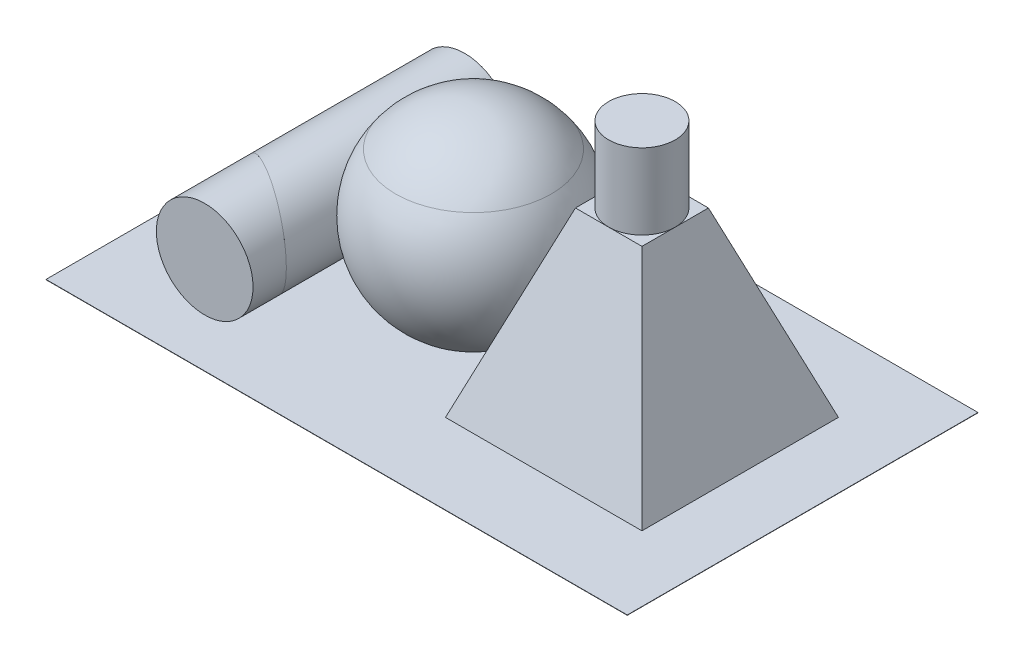
ISO-10303-21;
HEADER;
FILE_DESCRIPTION(('STEP AP214'),'2;1');
FILE_NAME('part.step','',(''),(''),'','','');
FILE_SCHEMA(('AUTOMOTIVE_DESIGN { 1 0 10303 214 1 1 1 1 }'));
ENDSEC;
DATA;
#1=APPLICATION_CONTEXT('core data for automotive mechanical design processes');
#2=APPLICATION_PROTOCOL_DEFINITION('international standard','automotive_design',2000,#1);
#3=PRODUCT_CONTEXT('',#1,'mechanical');
#4=PRODUCT('Part','Part','',(#3));
#5=PRODUCT_RELATED_PRODUCT_CATEGORY('part','',(#4));
#6=PRODUCT_DEFINITION_FORMATION('','',#4);
#7=PRODUCT_DEFINITION_CONTEXT('part definition',#1,'design');
#8=PRODUCT_DEFINITION('design','',#6,#7);
#9=PRODUCT_DEFINITION_SHAPE('','',#8);
#10=(LENGTH_UNIT() NAMED_UNIT(*) SI_UNIT(.MILLI.,.METRE.));
#11=(NAMED_UNIT(*) PLANE_ANGLE_UNIT() SI_UNIT($,.RADIAN.));
#12=(NAMED_UNIT(*) SI_UNIT($,.STERADIAN.) SOLID_ANGLE_UNIT());
#13=UNCERTAINTY_MEASURE_WITH_UNIT(LENGTH_MEASURE(1.E-05),#10,'distance_accuracy_value','');
#14=(GEOMETRIC_REPRESENTATION_CONTEXT(3) GLOBAL_UNCERTAINTY_ASSIGNED_CONTEXT((#13)) GLOBAL_UNIT_ASSIGNED_CONTEXT((#10,
#11,#12)) REPRESENTATION_CONTEXT('',''));
#15=CARTESIAN_POINT('',(0.,0.,0.));
#16=DIRECTION('',(0.,0.,1.));
#17=DIRECTION('',(1.,0.,0.));
#18=AXIS2_PLACEMENT_3D('',#15,#16,#17);
#19=CARTESIAN_POINT('',(-105.610948662013,-0.1,-56.9919444298044));
#20=DIRECTION('',(-1.,0.,0.));
#21=DIRECTION('',(0.,0.,1.));
#22=AXIS2_PLACEMENT_3D('',#19,#20,#21);
#23=PLANE('',#22);
#24=DIRECTION('',(0.,0.,1.));
#25=VECTOR('',#24,1.);
#26=CARTESIAN_POINT('',(-105.610948662013,0.,-56.9919444298044));
#27=LINE('',#26,#25);
#28=CARTESIAN_POINT('',(-105.610948662013,0.,-56.9919444298044));
#29=VERTEX_POINT('',#28);
#30=CARTESIAN_POINT('',(-105.610948662013,0.,59.0420143733231));
#31=VERTEX_POINT('',#30);
#32=EDGE_CURVE('E114',#29,#31,#27,.T.);
#33=ORIENTED_EDGE('',*,*,#32,.F.);
#34=DIRECTION('',(0.,1.,0.));
#35=VECTOR('',#34,1.);
#36=CARTESIAN_POINT('',(-105.610948662013,-0.1,-56.9919444298044));
#37=LINE('',#36,#35);
#38=CARTESIAN_POINT('',(-105.610948662013,-0.1,-56.9919444298044));
#39=VERTEX_POINT('',#38);
#40=EDGE_CURVE('E12',#39,#29,#37,.T.);
#41=ORIENTED_EDGE('',*,*,#40,.F.);
#42=DIRECTION('',(0.,0.,1.));
#43=VECTOR('',#42,1.);
#44=CARTESIAN_POINT('',(-105.610948662013,-0.1,-56.9919444298044));
#45=LINE('',#44,#43);
#46=CARTESIAN_POINT('',(-105.610948662013,-0.1,59.0420143733231));
#47=VERTEX_POINT('',#46);
#48=EDGE_CURVE('E108',#39,#47,#45,.T.);
#49=ORIENTED_EDGE('',*,*,#48,.T.);
#50=DIRECTION('',(0.,1.,0.));
#51=VECTOR('',#50,1.);
#52=CARTESIAN_POINT('',(-105.610948662013,-0.1,59.0420143733231));
#53=LINE('',#52,#51);
#54=EDGE_CURVE('E53',#47,#31,#53,.T.);
#55=ORIENTED_EDGE('',*,*,#54,.T.);
#56=EDGE_LOOP('',(#33,#41,#49,#55));
#57=FACE_BOUND('',#56,.T.);
#58=ADVANCED_FACE('F50',(#57),#23,.T.);
#59=CARTESIAN_POINT('',(-105.610948662013,-0.1,-56.9919444298044));
#60=DIRECTION('',(0.,0.,-1.));
#61=DIRECTION('',(-1.,0.,0.));
#62=AXIS2_PLACEMENT_3D('',#59,#60,#61);
#63=PLANE('',#62);
#64=DIRECTION('',(-1.,0.,0.));
#65=VECTOR('',#64,1.);
#66=CARTESIAN_POINT('',(-105.610948662013,0.,-56.9919444298044));
#67=LINE('',#66,#65);
#68=CARTESIAN_POINT('',(86.6856120399894,0.,-56.9919444298044));
#69=VERTEX_POINT('',#68);
#70=EDGE_CURVE('E110',#69,#29,#67,.T.);
#71=ORIENTED_EDGE('',*,*,#70,.F.);
#72=DIRECTION('',(0.,1.,0.));
#73=VECTOR('',#72,1.);
#74=CARTESIAN_POINT('',(86.6856120399894,-0.1,-56.9919444298044));
#75=LINE('',#74,#73);
#76=CARTESIAN_POINT('',(86.6856120399894,-0.1,-56.9919444298044));
#77=VERTEX_POINT('',#76);
#78=EDGE_CURVE('E59',#77,#69,#75,.T.);
#79=ORIENTED_EDGE('',*,*,#78,.F.);
#80=DIRECTION('',(-1.,0.,0.));
#81=VECTOR('',#80,1.);
#82=CARTESIAN_POINT('',(-105.610948662013,-0.1,-56.9919444298044));
#83=LINE('',#82,#81);
#84=EDGE_CURVE('E105',#77,#39,#83,.T.);
#85=ORIENTED_EDGE('',*,*,#84,.T.);
#86=ORIENTED_EDGE('',*,*,#40,.T.);
#87=EDGE_LOOP('',(#71,#79,#85,#86));
#88=FACE_BOUND('',#87,.T.);
#89=ADVANCED_FACE('F124',(#88),#63,.T.);
#90=CARTESIAN_POINT('',(86.6856120399894,-0.1,-56.9919444298044));
#91=DIRECTION('',(1.,0.,0.));
#92=DIRECTION('',(0.,0.,-1.));
#93=AXIS2_PLACEMENT_3D('',#90,#91,#92);
#94=PLANE('',#93);
#95=DIRECTION('',(0.,0.,-1.));
#96=VECTOR('',#95,1.);
#97=CARTESIAN_POINT('',(86.6856120399894,0.,-56.9919444298044));
#98=LINE('',#97,#96);
#99=CARTESIAN_POINT('',(86.6856120399894,0.,59.0420143733231));
#100=VERTEX_POINT('',#99);
#101=EDGE_CURVE('E100',#100,#69,#98,.T.);
#102=ORIENTED_EDGE('',*,*,#101,.F.);
#103=DIRECTION('',(0.,1.,0.));
#104=VECTOR('',#103,1.);
#105=CARTESIAN_POINT('',(86.6856120399894,-0.1,59.0420143733231));
#106=LINE('',#105,#104);
#107=CARTESIAN_POINT('',(86.6856120399894,-0.1,59.0420143733231));
#108=VERTEX_POINT('',#107);
#109=EDGE_CURVE('E95',#108,#100,#106,.T.);
#110=ORIENTED_EDGE('',*,*,#109,.F.);
#111=DIRECTION('',(0.,0.,-1.));
#112=VECTOR('',#111,1.);
#113=CARTESIAN_POINT('',(86.6856120399894,-0.1,-56.9919444298044));
#114=LINE('',#113,#112);
#115=EDGE_CURVE('E98',#108,#77,#114,.T.);
#116=ORIENTED_EDGE('',*,*,#115,.T.);
#117=ORIENTED_EDGE('',*,*,#78,.T.);
#118=EDGE_LOOP('',(#102,#110,#116,#117));
#119=FACE_BOUND('',#118,.T.);
#120=ADVANCED_FACE('F97',(#119),#94,.T.);
#121=CARTESIAN_POINT('',(-105.610948662013,-0.1,59.0420143733231));
#122=DIRECTION('',(0.,0.,1.));
#123=DIRECTION('',(1.,0.,0.));
#124=AXIS2_PLACEMENT_3D('',#121,#122,#123);
#125=PLANE('',#124);
#126=DIRECTION('',(1.,0.,0.));
#127=VECTOR('',#126,1.);
#128=CARTESIAN_POINT('',(-105.610948662013,0.,59.0420143733231));
#129=LINE('',#128,#127);
#130=EDGE_CURVE('E117',#31,#100,#129,.T.);
#131=ORIENTED_EDGE('',*,*,#130,.F.);
#132=ORIENTED_EDGE('',*,*,#54,.F.);
#133=DIRECTION('',(1.,0.,0.));
#134=VECTOR('',#133,1.);
#135=CARTESIAN_POINT('',(-105.610948662013,-0.1,59.0420143733231));
#136=LINE('',#135,#134);
#137=EDGE_CURVE('E104',#47,#108,#136,.T.);
#138=ORIENTED_EDGE('',*,*,#137,.T.);
#139=ORIENTED_EDGE('',*,*,#109,.T.);
#140=EDGE_LOOP('',(#131,#132,#138,#139));
#141=FACE_BOUND('',#140,.T.);
#142=ADVANCED_FACE('F107',(#141),#125,.T.);
#143=CARTESIAN_POINT('',(0.,-0.1,0.));
#144=DIRECTION('',(0.,1.,0.));
#145=DIRECTION('',(0.,0.,1.));
#146=AXIS2_PLACEMENT_3D('',#143,#144,#145);
#147=PLANE('',#146);
#148=ORIENTED_EDGE('',*,*,#48,.F.);
#149=ORIENTED_EDGE('',*,*,#84,.F.);
#150=ORIENTED_EDGE('',*,*,#115,.F.);
#151=ORIENTED_EDGE('',*,*,#137,.F.);
#152=EDGE_LOOP('',(#148,#149,#150,#151));
#153=FACE_BOUND('',#152,.T.);
#154=ADVANCED_FACE('F103',(#153),#147,.F.);
#155=CARTESIAN_POINT('',(0.,0.,0.));
#156=DIRECTION('',(0.,1.,0.));
#157=DIRECTION('',(0.,0.,1.));
#158=AXIS2_PLACEMENT_3D('',#155,#156,#157);
#159=PLANE('',#158);
#160=ORIENTED_EDGE('',*,*,#32,.T.);
#161=ORIENTED_EDGE('',*,*,#130,.T.);
#162=ORIENTED_EDGE('',*,*,#101,.T.);
#163=ORIENTED_EDGE('',*,*,#70,.T.);
#164=EDGE_LOOP('',(#160,#161,#162,#163));
#165=FACE_BOUND('',#164,.T.);
#166=ADVANCED_FACE('F123',(#165),#159,.T.);
#167=CLOSED_SHELL('',(#58,#89,#120,#142,#154,#166));
#168=MANIFOLD_SOLID_BREP('B2',#167);
#169=CARTESIAN_POINT('',(-69.1553785881351,16.,-25.9929118946907));
#170=DIRECTION('',(0.,0.,1.));
#171=DIRECTION('',(1.,0.,0.));
#172=AXIS2_PLACEMENT_3D('',#169,#170,#171);
#173=CYLINDRICAL_SURFACE('',#172,16.);
#174=CARTESIAN_POINT('',(-69.1553785881351,16.,22.7623956929661));
#175=DIRECTION('',(-0.499999999999998,0.,0.86602540378444));
#176=DIRECTION('',(0.86602540378444,0.,0.499999999999998));
#177=AXIS2_PLACEMENT_3D('',#174,#175,#176);
#178=ELLIPSE('',#177,18.475208614068,16.);
#179=CARTESIAN_POINT('',(-53.1553785881351,16.,32.));
#180=VERTEX_POINT('',#179);
#181=EDGE_CURVE('E49',#180,#180,#178,.F.);
#182=ORIENTED_EDGE('',*,*,#181,.F.);
#183=EDGE_LOOP('',(#182));
#184=FACE_BOUND('',#183,.T.);
#185=CARTESIAN_POINT('',(-69.1553785881351,16.,43.));
#186=DIRECTION('',(0.,0.,1.));
#187=DIRECTION('',(1.,0.,0.));
#188=AXIS2_PLACEMENT_3D('',#185,#186,#187);
#189=CIRCLE('',#188,16.);
#190=CARTESIAN_POINT('',(-53.1553785881351,16.,43.));
#191=VERTEX_POINT('',#190);
#192=EDGE_CURVE('E188',#191,#191,#189,.T.);
#193=ORIENTED_EDGE('',*,*,#192,.F.);
#194=EDGE_LOOP('',(#193));
#195=FACE_BOUND('',#194,.T.);
#196=ADVANCED_FACE('F182',(#184,#195),#173,.T.);
#197=CARTESIAN_POINT('',(-69.1553785881351,16.,43.));
#198=DIRECTION('',(0.,0.,1.));
#199=DIRECTION('',(1.,0.,0.));
#200=AXIS2_PLACEMENT_3D('',#197,#198,#199);
#201=PLANE('',#200);
#202=ORIENTED_EDGE('',*,*,#192,.T.);
#203=EDGE_LOOP('',(#202));
#204=FACE_BOUND('',#203,.T.);
#205=ADVANCED_FACE('F194',(#204),#201,.T.);
#206=CARTESIAN_POINT('',(-53.1553785881351,62.,32.));
#207=DIRECTION('',(-0.499999999999998,0.,0.86602540378444));
#208=DIRECTION('',(0.86602540378444,0.,0.499999999999998));
#209=AXIS2_PLACEMENT_3D('',#206,#207,#208);
#210=PLANE('',#209);
#211=ORIENTED_EDGE('',*,*,#181,.T.);
#212=EDGE_LOOP('',(#211));
#213=FACE_BOUND('',#212,.T.);
#214=ADVANCED_FACE('F201',(#213),#210,.F.);
#215=CLOSED_SHELL('',(#196,#205,#214));
#216=MANIFOLD_SOLID_BREP('B6',#215);
#217=CARTESIAN_POINT('',(-69.1553785881351,16.,43.));
#218=DIRECTION('',(0.,0.,-1.));
#219=DIRECTION('',(-1.,0.,0.));
#220=AXIS2_PLACEMENT_3D('',#217,#218,#219);
#221=CYLINDRICAL_SURFACE('',#220,16.);
#222=CARTESIAN_POINT('',(-69.1553785881351,16.,-43.));
#223=DIRECTION('',(0.,0.,1.));
#224=DIRECTION('',(1.,0.,0.));
#225=AXIS2_PLACEMENT_3D('',#222,#223,#224);
#226=CIRCLE('',#225,16.);
#227=CARTESIAN_POINT('',(-53.1553785881351,16.,-43.));
#228=VERTEX_POINT('',#227);
#229=EDGE_CURVE('E237',#228,#228,#226,.T.);
#230=ORIENTED_EDGE('',*,*,#229,.T.);
#231=EDGE_LOOP('',(#230));
#232=FACE_BOUND('',#231,.T.);
#233=CARTESIAN_POINT('',(-69.1553785881351,16.,22.7623956929661));
#234=DIRECTION('',(-0.499999999999998,0.,0.86602540378444));
#235=DIRECTION('',(-0.86602540378444,0.,-0.499999999999998));
#236=AXIS2_PLACEMENT_3D('',#233,#234,#235);
#237=ELLIPSE('',#236,18.475208614068,16.);
#238=CARTESIAN_POINT('',(-85.1553785881351,16.,13.5247913859321));
#239=VERTEX_POINT('',#238);
#240=EDGE_CURVE('E181',#239,#239,#237,.T.);
#241=ORIENTED_EDGE('',*,*,#240,.F.);
#242=EDGE_LOOP('',(#241));
#243=FACE_BOUND('',#242,.T.);
#244=ADVANCED_FACE('F231',(#232,#243),#221,.T.);
#245=CARTESIAN_POINT('',(-69.1553785881351,16.,-43.));
#246=DIRECTION('',(0.,0.,1.));
#247=DIRECTION('',(1.,0.,0.));
#248=AXIS2_PLACEMENT_3D('',#245,#246,#247);
#249=PLANE('',#248);
#250=ORIENTED_EDGE('',*,*,#229,.F.);
#251=EDGE_LOOP('',(#250));
#252=FACE_BOUND('',#251,.T.);
#253=ADVANCED_FACE('F245',(#252),#249,.F.);
#254=CARTESIAN_POINT('',(-53.1553785881351,62.,32.));
#255=DIRECTION('',(-0.499999999999998,0.,0.86602540378444));
#256=DIRECTION('',(0.86602540378444,0.,0.499999999999998));
#257=AXIS2_PLACEMENT_3D('',#254,#255,#256);
#258=PLANE('',#257);
#259=ORIENTED_EDGE('',*,*,#240,.T.);
#260=EDGE_LOOP('',(#259));
#261=FACE_BOUND('',#260,.T.);
#262=ADVANCED_FACE('F247',(#261),#258,.T.);
#263=CLOSED_SHELL('',(#244,#253,#262));
#264=MANIFOLD_SOLID_BREP('B44',#263);
#265=CARTESIAN_POINT('',(-23.2424174551391,49.,0.));
#266=DIRECTION('',(0.,-1.,0.));
#267=DIRECTION('',(0.,0.,-1.));
#268=AXIS2_PLACEMENT_3D('',#265,#266,#267);
#269=PLANE('',#268);
#270=CARTESIAN_POINT('',(-23.2424174551391,49.,0.));
#271=DIRECTION('',(0.,-1.,0.));
#272=DIRECTION('',(0.,0.,-1.));
#273=AXIS2_PLACEMENT_3D('',#270,#271,#272);
#274=CIRCLE('',#273,25.7487863791675);
#275=CARTESIAN_POINT('',(-23.2424174551391,49.,-25.7487863791675));
#276=VERTEX_POINT('',#275);
#277=EDGE_CURVE('E230',#276,#276,#274,.T.);
#278=ORIENTED_EDGE('',*,*,#277,.T.);
#279=EDGE_LOOP('',(#278));
#280=FACE_BOUND('',#279,.T.);
#281=ADVANCED_FACE('F282',(#280),#269,.T.);
#282=CARTESIAN_POINT('',(-23.2424174551391,30.,0.));
#283=DIRECTION('',(0.,-1.,0.));
#284=DIRECTION('',(1.,0.,0.));
#285=AXIS2_PLACEMENT_3D('',#282,#283,#284);
#286=SPHERICAL_SURFACE('',#285,32.);
#287=ORIENTED_EDGE('',*,*,#277,.F.);
#288=EDGE_LOOP('',(#287));
#289=FACE_BOUND('',#288,.T.);
#290=ADVANCED_FACE('F290',(#289),#286,.T.);
#291=CLOSED_SHELL('',(#281,#290));
#292=MANIFOLD_SOLID_BREP('B176',#291);
#293=CARTESIAN_POINT('',(-12.106888729479,0.,0.));
#294=DIRECTION('',(0.,-1.,0.));
#295=DIRECTION('',(0.,0.,-1.));
#296=AXIS2_PLACEMENT_3D('',#293,#294,#295);
#297=PLANE('',#296);
#298=CARTESIAN_POINT('',(-23.2424174551391,0.,0.));
#299=DIRECTION('',(0.,-1.,0.));
#300=DIRECTION('',(0.,0.,-1.));
#301=AXIS2_PLACEMENT_3D('',#298,#299,#300);
#302=CIRCLE('',#301,11.13552872566);
#303=CARTESIAN_POINT('',(-23.2424174551391,0.,-11.13552872566));
#304=VERTEX_POINT('',#303);
#305=EDGE_CURVE('E280',#304,#304,#302,.T.);
#306=ORIENTED_EDGE('',*,*,#305,.T.);
#307=EDGE_LOOP('',(#306));
#308=FACE_BOUND('',#307,.T.);
#309=ADVANCED_FACE('F317',(#308),#297,.T.);
#310=CARTESIAN_POINT('',(-23.2424174551391,30.,0.));
#311=DIRECTION('',(0.,-1.,0.));
#312=DIRECTION('',(1.,0.,0.));
#313=AXIS2_PLACEMENT_3D('',#310,#311,#312);
#314=SPHERICAL_SURFACE('',#313,32.);
#315=CARTESIAN_POINT('',(-53.8510582104697,20.6666666666667,0.));
#316=VERTEX_POINT('',#315);
#317=VERTEX_LOOP('',#316);
#318=FACE_BOUND('',#317,.T.);
#319=CARTESIAN_POINT('',(-23.2424174551391,49.,0.));
#320=DIRECTION('',(0.,-1.,0.));
#321=DIRECTION('',(0.,0.,-1.));
#322=AXIS2_PLACEMENT_3D('',#319,#320,#321);
#323=CIRCLE('',#322,25.7487863791675);
#324=CARTESIAN_POINT('',(-23.2424174551391,49.,-25.7487863791675));
#325=VERTEX_POINT('',#324);
#326=EDGE_CURVE('E323',#325,#325,#323,.T.);
#327=ORIENTED_EDGE('',*,*,#326,.T.);
#328=EDGE_LOOP('',(#327));
#329=FACE_BOUND('',#328,.T.);
#330=ORIENTED_EDGE('',*,*,#305,.F.);
#331=EDGE_LOOP('',(#330));
#332=FACE_BOUND('',#331,.T.);
#333=ADVANCED_FACE('F326',(#318,#329,#332),#314,.T.);
#334=CARTESIAN_POINT('',(-23.2424174551391,49.,0.));
#335=DIRECTION('',(0.,1.,0.));
#336=DIRECTION('',(0.,0.,1.));
#337=AXIS2_PLACEMENT_3D('',#334,#335,#336);
#338=PLANE('',#337);
#339=ORIENTED_EDGE('',*,*,#326,.F.);
#340=EDGE_LOOP('',(#339));
#341=FACE_BOUND('',#340,.T.);
#342=ADVANCED_FACE('F329',(#341),#338,.T.);
#343=CLOSED_SHELL('',(#309,#333,#342));
#344=MANIFOLD_SOLID_BREP('B225',#343);
#345=CARTESIAN_POINT('',(43.5,60.,32.5));
#346=DIRECTION('',(0.,-1.,0.));
#347=DIRECTION('',(0.,0.,-1.));
#348=AXIS2_PLACEMENT_3D('',#345,#346,#347);
#349=PLANE('',#348);
#350=CARTESIAN_POINT('',(32.5,60.,0.));
#351=DIRECTION('',(0.,1.,0.));
#352=DIRECTION('',(0.,0.,1.));
#353=AXIS2_PLACEMENT_3D('',#350,#351,#352);
#354=CIRCLE('',#353,11.);
#355=CARTESIAN_POINT('',(32.5,60.,-11.));
#356=VERTEX_POINT('',#355);
#357=CARTESIAN_POINT('',(21.5,60.,0.));
#358=VERTEX_POINT('',#357);
#359=EDGE_CURVE('E435',#356,#358,#354,.T.);
#360=ORIENTED_EDGE('',*,*,#359,.F.);
#361=DIRECTION('',(-1.,0.,0.));
#362=VECTOR('',#361,1.);
#363=CARTESIAN_POINT('',(65.,60.,-11.));
#364=LINE('',#363,#362);
#365=CARTESIAN_POINT('',(21.5,60.,-11.));
#366=VERTEX_POINT('',#365);
#367=EDGE_CURVE('E423',#356,#366,#364,.T.);
#368=ORIENTED_EDGE('',*,*,#367,.T.);
#369=DIRECTION('',(0.,0.,-1.));
#370=VECTOR('',#369,1.);
#371=CARTESIAN_POINT('',(21.5,60.,32.5));
#372=LINE('',#371,#370);
#373=EDGE_CURVE('E436',#358,#366,#372,.T.);
#374=ORIENTED_EDGE('',*,*,#373,.F.);
#375=EDGE_LOOP('',(#360,#368,#374));
#376=FACE_BOUND('',#375,.T.);
#377=ADVANCED_FACE('F358',(#376),#349,.F.);
#378=CARTESIAN_POINT('',(32.5,60.,11.));
#379=VERTEX_POINT('',#378);
#380=EDGE_CURVE('E382',#358,#379,#354,.T.);
#381=ORIENTED_EDGE('',*,*,#380,.F.);
#382=CARTESIAN_POINT('',(21.5,60.,11.));
#383=VERTEX_POINT('',#382);
#384=EDGE_CURVE('E470',#383,#358,#372,.T.);
#385=ORIENTED_EDGE('',*,*,#384,.F.);
#386=DIRECTION('',(-1.,0.,0.));
#387=VECTOR('',#386,1.);
#388=CARTESIAN_POINT('',(65.,60.,11.));
#389=LINE('',#388,#387);
#390=EDGE_CURVE('E452',#379,#383,#389,.T.);
#391=ORIENTED_EDGE('',*,*,#390,.F.);
#392=EDGE_LOOP('',(#381,#385,#391));
#393=FACE_BOUND('',#392,.T.);
#394=ADVANCED_FACE('F510',(#393),#349,.F.);
#395=CARTESIAN_POINT('',(43.5,60.,0.));
#396=VERTEX_POINT('',#395);
#397=EDGE_CURVE('E443',#379,#396,#354,.T.);
#398=ORIENTED_EDGE('',*,*,#397,.F.);
#399=CARTESIAN_POINT('',(43.5,60.,11.));
#400=VERTEX_POINT('',#399);
#401=EDGE_CURVE('E433',#400,#379,#389,.T.);
#402=ORIENTED_EDGE('',*,*,#401,.F.);
#403=DIRECTION('',(0.,0.,-1.));
#404=VECTOR('',#403,1.);
#405=CARTESIAN_POINT('',(43.5,60.,32.5));
#406=LINE('',#405,#404);
#407=EDGE_CURVE('E473',#400,#396,#406,.T.);
#408=ORIENTED_EDGE('',*,*,#407,.T.);
#409=EDGE_LOOP('',(#398,#402,#408));
#410=FACE_BOUND('',#409,.T.);
#411=ADVANCED_FACE('F515',(#410),#349,.F.);
#412=CARTESIAN_POINT('',(21.5,60.,32.5));
#413=DIRECTION('',(0.941386414844765,-0.337330131986041,0.));
#414=DIRECTION('',(0.337330131986041,0.941386414844765,0.));
#415=AXIS2_PLACEMENT_3D('',#412,#413,#414);
#416=PLANE('',#415);
#417=CARTESIAN_POINT('',(6.8819478198934,19.2054357764467,0.));
#418=VERTEX_POINT('',#417);
#419=VERTEX_LOOP('',#418);
#420=FACE_BOUND('',#419,.T.);
#421=DIRECTION('',(0.319634142719037,0.892002258750802,0.319634142719037));
#422=VECTOR('',#421,1.);
#423=CARTESIAN_POINT('',(25.9442203558404,72.4024754116477,-6.55577964415958));
#424=LINE('',#423,#422);
#425=CARTESIAN_POINT('',(0.,0.,-32.5));
#426=VERTEX_POINT('',#425);
#427=EDGE_CURVE('E430',#426,#366,#424,.T.);
#428=ORIENTED_EDGE('',*,*,#427,.F.);
#429=DIRECTION('',(0.,0.,-1.));
#430=VECTOR('',#429,1.);
#431=CARTESIAN_POINT('',(0.,0.,32.5));
#432=LINE('',#431,#430);
#433=CARTESIAN_POINT('',(0.,0.,32.5));
#434=VERTEX_POINT('',#433);
#435=EDGE_CURVE('E315',#434,#426,#432,.T.);
#436=ORIENTED_EDGE('',*,*,#435,.F.);
#437=DIRECTION('',(-0.319634142719037,-0.892002258750802,0.319634142719038));
#438=VECTOR('',#437,1.);
#439=CARTESIAN_POINT('',(19.3034313183777,53.870040888496,13.1965686816223));
#440=LINE('',#439,#438);
#441=EDGE_CURVE('E460',#383,#434,#440,.T.);
#442=ORIENTED_EDGE('',*,*,#441,.F.);
#443=ORIENTED_EDGE('',*,*,#384,.T.);
#444=ORIENTED_EDGE('',*,*,#373,.T.);
#445=EDGE_LOOP('',(#428,#436,#442,#443,#444));
#446=FACE_BOUND('',#445,.T.);
#447=ADVANCED_FACE('F360',(#420,#446),#416,.F.);
#448=CARTESIAN_POINT('',(65.,0.,32.5));
#449=DIRECTION('',(-0.941386414844765,-0.337330131986041,0.));
#450=DIRECTION('',(0.337330131986041,-0.941386414844765,0.));
#451=AXIS2_PLACEMENT_3D('',#448,#449,#450);
#452=PLANE('',#451);
#453=DIRECTION('',(0.319634142719037,-0.892002258750802,-0.319634142719037));
#454=VECTOR('',#453,1.);
#455=CARTESIAN_POINT('',(58.3592109625373,18.5324345231517,-25.8592109625373));
#456=LINE('',#455,#454);
#457=CARTESIAN_POINT('',(43.5,60.,-11.));
#458=VERTEX_POINT('',#457);
#459=CARTESIAN_POINT('',(65.,0.,-32.5));
#460=VERTEX_POINT('',#459);
#461=EDGE_CURVE('E422',#458,#460,#456,.T.);
#462=ORIENTED_EDGE('',*,*,#461,.F.);
#463=EDGE_CURVE('E418',#396,#458,#406,.T.);
#464=ORIENTED_EDGE('',*,*,#463,.F.);
#465=ORIENTED_EDGE('',*,*,#407,.F.);
#466=DIRECTION('',(-0.319634142719037,0.892002258750802,-0.319634142719038));
#467=VECTOR('',#466,1.);
#468=CARTESIAN_POINT('',(65.,0.,32.5));
#469=LINE('',#468,#467);
#470=CARTESIAN_POINT('',(65.,0.,32.5));
#471=VERTEX_POINT('',#470);
#472=EDGE_CURVE('E457',#471,#400,#469,.T.);
#473=ORIENTED_EDGE('',*,*,#472,.F.);
#474=DIRECTION('',(0.,0.,-1.));
#475=VECTOR('',#474,1.);
#476=CARTESIAN_POINT('',(65.,0.,32.5));
#477=LINE('',#476,#475);
#478=EDGE_CURVE('E367',#471,#460,#477,.T.);
#479=ORIENTED_EDGE('',*,*,#478,.T.);
#480=EDGE_LOOP('',(#462,#464,#465,#473,#479));
#481=FACE_BOUND('',#480,.T.);
#482=ADVANCED_FACE('F481',(#481),#452,.F.);
#483=EDGE_CURVE('E374',#396,#356,#354,.T.);
#484=ORIENTED_EDGE('',*,*,#483,.F.);
#485=ORIENTED_EDGE('',*,*,#463,.T.);
#486=EDGE_CURVE('E415',#458,#356,#364,.T.);
#487=ORIENTED_EDGE('',*,*,#486,.T.);
#488=EDGE_LOOP('',(#484,#485,#487));
#489=FACE_BOUND('',#488,.T.);
#490=ADVANCED_FACE('F417',(#489),#349,.F.);
#491=CARTESIAN_POINT('',(0.,0.,32.5));
#492=DIRECTION('',(0.,1.,0.));
#493=DIRECTION('',(0.,0.,1.));
#494=AXIS2_PLACEMENT_3D('',#491,#492,#493);
#495=PLANE('',#494);
#496=DIRECTION('',(1.,0.,0.));
#497=VECTOR('',#496,1.);
#498=CARTESIAN_POINT('',(0.,0.,-32.5));
#499=LINE('',#498,#497);
#500=EDGE_CURVE('E463',#426,#460,#499,.T.);
#501=ORIENTED_EDGE('',*,*,#500,.T.);
#502=ORIENTED_EDGE('',*,*,#478,.F.);
#503=DIRECTION('',(1.,0.,0.));
#504=VECTOR('',#503,1.);
#505=CARTESIAN_POINT('',(0.,0.,32.5));
#506=LINE('',#505,#504);
#507=EDGE_CURVE('E464',#434,#471,#506,.T.);
#508=ORIENTED_EDGE('',*,*,#507,.F.);
#509=ORIENTED_EDGE('',*,*,#435,.T.);
#510=EDGE_LOOP('',(#501,#502,#508,#509));
#511=FACE_BOUND('',#510,.T.);
#512=ADVANCED_FACE('F485',(#511),#495,.F.);
#513=CARTESIAN_POINT('',(65.,0.,-32.5));
#514=DIRECTION('',(0.,0.337330131986041,-0.941386414844765));
#515=DIRECTION('',(0.,0.941386414844765,0.337330131986041));
#516=AXIS2_PLACEMENT_3D('',#513,#514,#515);
#517=PLANE('',#516);
#518=ORIENTED_EDGE('',*,*,#427,.T.);
#519=ORIENTED_EDGE('',*,*,#367,.F.);
#520=ORIENTED_EDGE('',*,*,#486,.F.);
#521=ORIENTED_EDGE('',*,*,#461,.T.);
#522=ORIENTED_EDGE('',*,*,#500,.F.);
#523=EDGE_LOOP('',(#518,#519,#520,#521,#522));
#524=FACE_BOUND('',#523,.T.);
#525=ADVANCED_FACE('F428',(#524),#517,.T.);
#526=CARTESIAN_POINT('',(65.,0.,32.5));
#527=DIRECTION('',(0.,0.337330131986041,0.941386414844765));
#528=DIRECTION('',(0.,-0.941386414844765,0.337330131986041));
#529=AXIS2_PLACEMENT_3D('',#526,#527,#528);
#530=PLANE('',#529);
#531=ORIENTED_EDGE('',*,*,#441,.T.);
#532=ORIENTED_EDGE('',*,*,#507,.T.);
#533=ORIENTED_EDGE('',*,*,#472,.T.);
#534=ORIENTED_EDGE('',*,*,#401,.T.);
#535=ORIENTED_EDGE('',*,*,#390,.T.);
#536=EDGE_LOOP('',(#531,#532,#533,#534,#535));
#537=FACE_BOUND('',#536,.T.);
#538=ADVANCED_FACE('F499',(#537),#530,.T.);
#539=CARTESIAN_POINT('',(32.5,85.,0.));
#540=DIRECTION('',(0.,-1.,0.));
#541=DIRECTION('',(0.,0.,-1.));
#542=AXIS2_PLACEMENT_3D('',#539,#540,#541);
#543=CYLINDRICAL_SURFACE('',#542,11.);
#544=CARTESIAN_POINT('',(32.5,85.,0.));
#545=DIRECTION('',(0.,1.,0.));
#546=DIRECTION('',(0.,0.,1.));
#547=AXIS2_PLACEMENT_3D('',#544,#545,#546);
#548=CIRCLE('',#547,11.);
#549=CARTESIAN_POINT('',(32.5,85.,11.));
#550=VERTEX_POINT('',#549);
#551=EDGE_CURVE('E446',#550,#550,#548,.T.);
#552=ORIENTED_EDGE('',*,*,#551,.F.);
#553=EDGE_LOOP('',(#552));
#554=FACE_BOUND('',#553,.T.);
#555=ORIENTED_EDGE('',*,*,#397,.T.);
#556=ORIENTED_EDGE('',*,*,#483,.T.);
#557=ORIENTED_EDGE('',*,*,#359,.T.);
#558=ORIENTED_EDGE('',*,*,#380,.T.);
#559=EDGE_LOOP('',(#555,#556,#557,#558));
#560=FACE_BOUND('',#559,.T.);
#561=ADVANCED_FACE('F442',(#554,#560),#543,.T.);
#562=CARTESIAN_POINT('',(32.5,85.,0.));
#563=DIRECTION('',(0.,1.,0.));
#564=DIRECTION('',(0.,0.,1.));
#565=AXIS2_PLACEMENT_3D('',#562,#563,#564);
#566=PLANE('',#565);
#567=ORIENTED_EDGE('',*,*,#551,.T.);
#568=EDGE_LOOP('',(#567));
#569=FACE_BOUND('',#568,.T.);
#570=ADVANCED_FACE('F496',(#569),#566,.T.);
#571=CLOSED_SHELL('',(#377,#394,#411,#447,#482,#490,#512,#525,#538,#561,#570));
#572=MANIFOLD_SOLID_BREP('B274',#571);
#573=ADVANCED_BREP_SHAPE_REPRESENTATION('',(#18,#168,#216,#264,#292,#344,#572),#14);
#574=SHAPE_DEFINITION_REPRESENTATION(#9,#573);
ENDSEC;
END-ISO-10303-21;
